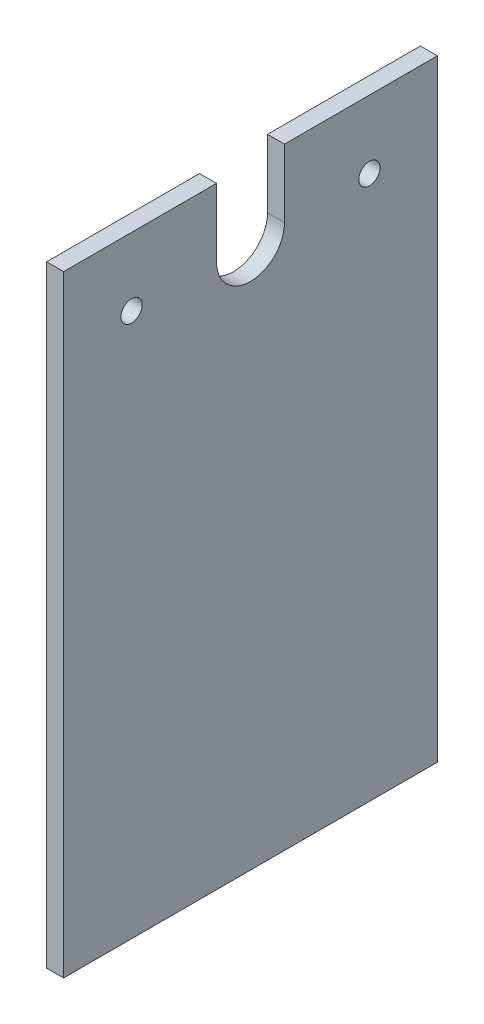
ISO-10303-21;
HEADER;
FILE_DESCRIPTION(('STEP AP214'),'2;1');
FILE_NAME('part.step','',(''),(''),'','','');
FILE_SCHEMA(('AUTOMOTIVE_DESIGN { 1 0 10303 214 1 1 1 1 }'));
ENDSEC;
DATA;
#1=APPLICATION_CONTEXT('core data for automotive mechanical design processes');
#2=APPLICATION_PROTOCOL_DEFINITION('international standard','automotive_design',2000,#1);
#3=PRODUCT_CONTEXT('',#1,'mechanical');
#4=PRODUCT('Part','Part','',(#3));
#5=PRODUCT_RELATED_PRODUCT_CATEGORY('part','',(#4));
#6=PRODUCT_DEFINITION_FORMATION('','',#4);
#7=PRODUCT_DEFINITION_CONTEXT('part definition',#1,'design');
#8=PRODUCT_DEFINITION('design','',#6,#7);
#9=PRODUCT_DEFINITION_SHAPE('','',#8);
#10=(LENGTH_UNIT() NAMED_UNIT(*) SI_UNIT(.MILLI.,.METRE.));
#11=(NAMED_UNIT(*) PLANE_ANGLE_UNIT() SI_UNIT($,.RADIAN.));
#12=(NAMED_UNIT(*) SI_UNIT($,.STERADIAN.) SOLID_ANGLE_UNIT());
#13=UNCERTAINTY_MEASURE_WITH_UNIT(LENGTH_MEASURE(1.E-05),#10,'distance_accuracy_value','');
#14=(GEOMETRIC_REPRESENTATION_CONTEXT(3) GLOBAL_UNCERTAINTY_ASSIGNED_CONTEXT((#13)) GLOBAL_UNIT_ASSIGNED_CONTEXT((#10,
#11,#12)) REPRESENTATION_CONTEXT('',''));
#15=CARTESIAN_POINT('',(0.,0.,0.));
#16=DIRECTION('',(0.,0.,1.));
#17=DIRECTION('',(1.,0.,0.));
#18=AXIS2_PLACEMENT_3D('',#15,#16,#17);
#19=CARTESIAN_POINT('',(522.5,330.,-22.5));
#20=DIRECTION('',(0.,-1.,0.));
#21=DIRECTION('',(0.,0.,-1.));
#22=AXIS2_PLACEMENT_3D('',#19,#20,#21);
#23=PLANE('',#22);
#24=DIRECTION('',(0.,0.,1.));
#25=VECTOR('',#24,1.);
#26=CARTESIAN_POINT('',(512.5,330.,-22.5));
#27=LINE('',#26,#25);
#28=CARTESIAN_POINT('',(512.5,330.,-242.5));
#29=VERTEX_POINT('',#28);
#30=CARTESIAN_POINT('',(512.5,330.,-152.5));
#31=VERTEX_POINT('',#30);
#32=EDGE_CURVE('E130',#29,#31,#27,.T.);
#33=ORIENTED_EDGE('',*,*,#32,.T.);
#34=DIRECTION('',(-1.,0.,0.));
#35=VECTOR('',#34,1.);
#36=CARTESIAN_POINT('',(522.501,330.,-152.5));
#37=LINE('',#36,#35);
#38=CARTESIAN_POINT('',(522.5,330.,-152.5));
#39=VERTEX_POINT('',#38);
#40=EDGE_CURVE('E122',#39,#31,#37,.T.);
#41=ORIENTED_EDGE('',*,*,#40,.F.);
#42=DIRECTION('',(0.,0.,1.));
#43=VECTOR('',#42,1.);
#44=CARTESIAN_POINT('',(522.5,330.,-22.5));
#45=LINE('',#44,#43);
#46=CARTESIAN_POINT('',(522.5,330.,-242.5));
#47=VERTEX_POINT('',#46);
#48=EDGE_CURVE('E142',#47,#39,#45,.T.);
#49=ORIENTED_EDGE('',*,*,#48,.F.);
#50=DIRECTION('',(-1.,0.,0.));
#51=VECTOR('',#50,1.);
#52=CARTESIAN_POINT('',(522.5,330.,-242.5));
#53=LINE('',#52,#51);
#54=EDGE_CURVE('E141',#47,#29,#53,.T.);
#55=ORIENTED_EDGE('',*,*,#54,.T.);
#56=EDGE_LOOP('',(#33,#41,#49,#55));
#57=FACE_BOUND('',#56,.T.);
#58=ADVANCED_FACE('F39',(#57),#23,.F.);
#59=CARTESIAN_POINT('',(522.5,-30.,-22.5000000000004));
#60=DIRECTION('',(0.,0.,-1.));
#61=DIRECTION('',(0.,1.,0.));
#62=AXIS2_PLACEMENT_3D('',#59,#60,#61);
#63=PLANE('',#62);
#64=DIRECTION('',(0.,-1.,0.));
#65=VECTOR('',#64,1.);
#66=CARTESIAN_POINT('',(512.5,-30.,-22.5000000000004));
#67=LINE('',#66,#65);
#68=CARTESIAN_POINT('',(512.5,330.,-22.5));
#69=VERTEX_POINT('',#68);
#70=CARTESIAN_POINT('',(512.5,-30.,-22.5000000000004));
#71=VERTEX_POINT('',#70);
#72=EDGE_CURVE('E129',#69,#71,#67,.T.);
#73=ORIENTED_EDGE('',*,*,#72,.T.);
#74=DIRECTION('',(-1.,0.,0.));
#75=VECTOR('',#74,1.);
#76=CARTESIAN_POINT('',(522.5,-30.,-22.5000000000004));
#77=LINE('',#76,#75);
#78=CARTESIAN_POINT('',(522.5,-30.,-22.5000000000004));
#79=VERTEX_POINT('',#78);
#80=EDGE_CURVE('E12',#79,#71,#77,.T.);
#81=ORIENTED_EDGE('',*,*,#80,.F.);
#82=DIRECTION('',(0.,-1.,0.));
#83=VECTOR('',#82,1.);
#84=CARTESIAN_POINT('',(522.5,-30.,-22.5000000000004));
#85=LINE('',#84,#83);
#86=CARTESIAN_POINT('',(522.5,330.,-22.5));
#87=VERTEX_POINT('',#86);
#88=EDGE_CURVE('E134',#87,#79,#85,.T.);
#89=ORIENTED_EDGE('',*,*,#88,.F.);
#90=DIRECTION('',(-1.,0.,0.));
#91=VECTOR('',#90,1.);
#92=CARTESIAN_POINT('',(522.5,330.,-22.5));
#93=LINE('',#92,#91);
#94=EDGE_CURVE('E139',#87,#69,#93,.T.);
#95=ORIENTED_EDGE('',*,*,#94,.T.);
#96=EDGE_LOOP('',(#73,#81,#89,#95));
#97=FACE_BOUND('',#96,.T.);
#98=ADVANCED_FACE('F41',(#97),#63,.F.);
#99=CARTESIAN_POINT('',(522.5,-30.,-22.5000000000004));
#100=DIRECTION('',(0.,1.,0.));
#101=DIRECTION('',(0.,0.,1.));
#102=AXIS2_PLACEMENT_3D('',#99,#100,#101);
#103=PLANE('',#102);
#104=DIRECTION('',(0.,0.,-1.));
#105=VECTOR('',#104,1.);
#106=CARTESIAN_POINT('',(512.5,-30.,-22.5000000000004));
#107=LINE('',#106,#105);
#108=CARTESIAN_POINT('',(512.5,-30.,-242.5));
#109=VERTEX_POINT('',#108);
#110=EDGE_CURVE('E135',#71,#109,#107,.T.);
#111=ORIENTED_EDGE('',*,*,#110,.T.);
#112=DIRECTION('',(-1.,0.,0.));
#113=VECTOR('',#112,1.);
#114=CARTESIAN_POINT('',(522.5,-30.,-242.5));
#115=LINE('',#114,#113);
#116=CARTESIAN_POINT('',(522.5,-30.,-242.5));
#117=VERTEX_POINT('',#116);
#118=EDGE_CURVE('E47',#117,#109,#115,.T.);
#119=ORIENTED_EDGE('',*,*,#118,.F.);
#120=DIRECTION('',(0.,0.,-1.));
#121=VECTOR('',#120,1.);
#122=CARTESIAN_POINT('',(522.5,-30.,-22.5000000000004));
#123=LINE('',#122,#121);
#124=EDGE_CURVE('E92',#79,#117,#123,.T.);
#125=ORIENTED_EDGE('',*,*,#124,.F.);
#126=ORIENTED_EDGE('',*,*,#80,.T.);
#127=EDGE_LOOP('',(#111,#119,#125,#126));
#128=FACE_BOUND('',#127,.T.);
#129=ADVANCED_FACE('F195',(#128),#103,.F.);
#130=CARTESIAN_POINT('',(522.5,-30.,-242.5));
#131=DIRECTION('',(0.,0.,1.));
#132=DIRECTION('',(1.,0.,0.));
#133=AXIS2_PLACEMENT_3D('',#130,#131,#132);
#134=PLANE('',#133);
#135=DIRECTION('',(0.,1.,0.));
#136=VECTOR('',#135,1.);
#137=CARTESIAN_POINT('',(512.5,-30.,-242.5));
#138=LINE('',#137,#136);
#139=EDGE_CURVE('E131',#109,#29,#138,.T.);
#140=ORIENTED_EDGE('',*,*,#139,.T.);
#141=ORIENTED_EDGE('',*,*,#54,.F.);
#142=DIRECTION('',(0.,1.,0.));
#143=VECTOR('',#142,1.);
#144=CARTESIAN_POINT('',(522.5,-30.,-242.5));
#145=LINE('',#144,#143);
#146=EDGE_CURVE('E150',#117,#47,#145,.T.);
#147=ORIENTED_EDGE('',*,*,#146,.F.);
#148=ORIENTED_EDGE('',*,*,#118,.T.);
#149=EDGE_LOOP('',(#140,#141,#147,#148));
#150=FACE_BOUND('',#149,.T.);
#151=ADVANCED_FACE('F148',(#150),#134,.F.);
#152=CARTESIAN_POINT('',(522.5,330.,-112.5));
#153=VERTEX_POINT('',#152);
#154=EDGE_CURVE('E63',#153,#87,#45,.T.);
#155=ORIENTED_EDGE('',*,*,#154,.F.);
#156=DIRECTION('',(1.,0.,0.));
#157=VECTOR('',#156,1.);
#158=CARTESIAN_POINT('',(522.501,330.,-112.5));
#159=LINE('',#158,#157);
#160=CARTESIAN_POINT('',(512.5,330.,-112.5));
#161=VERTEX_POINT('',#160);
#162=EDGE_CURVE('E116',#161,#153,#159,.T.);
#163=ORIENTED_EDGE('',*,*,#162,.F.);
#164=EDGE_CURVE('E85',#161,#69,#27,.T.);
#165=ORIENTED_EDGE('',*,*,#164,.T.);
#166=ORIENTED_EDGE('',*,*,#94,.F.);
#167=EDGE_LOOP('',(#155,#163,#165,#166));
#168=FACE_BOUND('',#167,.T.);
#169=ADVANCED_FACE('F121',(#168),#23,.F.);
#170=CARTESIAN_POINT('',(522.5,0.,0.));
#171=DIRECTION('',(-1.,0.,0.));
#172=DIRECTION('',(0.,0.,1.));
#173=AXIS2_PLACEMENT_3D('',#170,#171,#172);
#174=PLANE('',#173);
#175=CARTESIAN_POINT('',(522.5,290.,-62.5));
#176=DIRECTION('',(-1.,0.,0.));
#177=DIRECTION('',(0.,0.,1.));
#178=AXIS2_PLACEMENT_3D('',#175,#176,#177);
#179=CIRCLE('',#178,6.25000000000001);
#180=CARTESIAN_POINT('',(522.5,290.,-56.25));
#181=VERTEX_POINT('',#180);
#182=EDGE_CURVE('E216',#181,#181,#179,.F.);
#183=ORIENTED_EDGE('',*,*,#182,.F.);
#184=EDGE_LOOP('',(#183));
#185=FACE_BOUND('',#184,.T.);
#186=CARTESIAN_POINT('',(522.5,290.,-202.5));
#187=DIRECTION('',(-1.,0.,0.));
#188=DIRECTION('',(0.,0.,1.));
#189=AXIS2_PLACEMENT_3D('',#186,#187,#188);
#190=CIRCLE('',#189,6.25);
#191=CARTESIAN_POINT('',(522.5,290.,-196.25));
#192=VERTEX_POINT('',#191);
#193=EDGE_CURVE('E123',#192,#192,#190,.F.);
#194=ORIENTED_EDGE('',*,*,#193,.F.);
#195=EDGE_LOOP('',(#194));
#196=FACE_BOUND('',#195,.T.);
#197=ORIENTED_EDGE('',*,*,#48,.T.);
#198=DIRECTION('',(0.,1.,0.));
#199=VECTOR('',#198,1.);
#200=CARTESIAN_POINT('',(522.5,290.,-152.5));
#201=LINE('',#200,#199);
#202=CARTESIAN_POINT('',(522.5,290.,-152.5));
#203=VERTEX_POINT('',#202);
#204=EDGE_CURVE('E210',#203,#39,#201,.T.);
#205=ORIENTED_EDGE('',*,*,#204,.F.);
#206=CARTESIAN_POINT('',(522.5,290.,-132.5));
#207=DIRECTION('',(-1.,0.,0.));
#208=DIRECTION('',(0.,0.,1.));
#209=AXIS2_PLACEMENT_3D('',#206,#207,#208);
#210=CIRCLE('',#209,20.);
#211=CARTESIAN_POINT('',(522.5,290.,-112.5));
#212=VERTEX_POINT('',#211);
#213=EDGE_CURVE('E213',#212,#203,#210,.F.);
#214=ORIENTED_EDGE('',*,*,#213,.F.);
#215=DIRECTION('',(0.,-1.,0.));
#216=VECTOR('',#215,1.);
#217=CARTESIAN_POINT('',(522.5,290.,-112.5));
#218=LINE('',#217,#216);
#219=EDGE_CURVE('E172',#153,#212,#218,.T.);
#220=ORIENTED_EDGE('',*,*,#219,.F.);
#221=ORIENTED_EDGE('',*,*,#154,.T.);
#222=ORIENTED_EDGE('',*,*,#88,.T.);
#223=ORIENTED_EDGE('',*,*,#124,.T.);
#224=ORIENTED_EDGE('',*,*,#146,.T.);
#225=EDGE_LOOP('',(#197,#205,#214,#220,#221,#222,#223,#224));
#226=FACE_BOUND('',#225,.T.);
#227=ADVANCED_FACE('F176',(#185,#196,#226),#174,.F.);
#228=CARTESIAN_POINT('',(512.5,0.,0.));
#229=DIRECTION('',(-1.,0.,0.));
#230=DIRECTION('',(0.,0.,1.));
#231=AXIS2_PLACEMENT_3D('',#228,#229,#230);
#232=PLANE('',#231);
#233=CARTESIAN_POINT('',(512.5,290.,-62.5));
#234=DIRECTION('',(-1.,0.,0.));
#235=DIRECTION('',(0.,0.,-1.));
#236=AXIS2_PLACEMENT_3D('',#233,#234,#235);
#237=CIRCLE('',#236,6.25000000000001);
#238=CARTESIAN_POINT('',(512.5,290.,-68.75));
#239=VERTEX_POINT('',#238);
#240=EDGE_CURVE('E220',#239,#239,#237,.T.);
#241=ORIENTED_EDGE('',*,*,#240,.F.);
#242=EDGE_LOOP('',(#241));
#243=FACE_BOUND('',#242,.T.);
#244=CARTESIAN_POINT('',(512.5,290.,-202.5));
#245=DIRECTION('',(-1.,0.,0.));
#246=DIRECTION('',(0.,0.,1.));
#247=AXIS2_PLACEMENT_3D('',#244,#245,#246);
#248=CIRCLE('',#247,6.25);
#249=CARTESIAN_POINT('',(512.5,290.,-196.25));
#250=VERTEX_POINT('',#249);
#251=EDGE_CURVE('E219',#250,#250,#248,.T.);
#252=ORIENTED_EDGE('',*,*,#251,.F.);
#253=EDGE_LOOP('',(#252));
#254=FACE_BOUND('',#253,.T.);
#255=DIRECTION('',(0.,-1.,0.));
#256=VECTOR('',#255,1.);
#257=CARTESIAN_POINT('',(512.5,290.,-152.5));
#258=LINE('',#257,#256);
#259=CARTESIAN_POINT('',(512.5,290.,-152.5));
#260=VERTEX_POINT('',#259);
#261=EDGE_CURVE('E119',#31,#260,#258,.T.);
#262=ORIENTED_EDGE('',*,*,#261,.F.);
#263=ORIENTED_EDGE('',*,*,#32,.F.);
#264=ORIENTED_EDGE('',*,*,#139,.F.);
#265=ORIENTED_EDGE('',*,*,#110,.F.);
#266=ORIENTED_EDGE('',*,*,#72,.F.);
#267=ORIENTED_EDGE('',*,*,#164,.F.);
#268=DIRECTION('',(0.,1.,0.));
#269=VECTOR('',#268,1.);
#270=CARTESIAN_POINT('',(512.5,290.,-112.5));
#271=LINE('',#270,#269);
#272=CARTESIAN_POINT('',(512.5,290.,-112.5));
#273=VERTEX_POINT('',#272);
#274=EDGE_CURVE('E113',#273,#161,#271,.T.);
#275=ORIENTED_EDGE('',*,*,#274,.F.);
#276=CARTESIAN_POINT('',(512.5,290.,-132.5));
#277=DIRECTION('',(-1.,0.,0.));
#278=DIRECTION('',(0.,0.,1.));
#279=AXIS2_PLACEMENT_3D('',#276,#277,#278);
#280=CIRCLE('',#279,20.);
#281=EDGE_CURVE('E54',#260,#273,#280,.T.);
#282=ORIENTED_EDGE('',*,*,#281,.F.);
#283=EDGE_LOOP('',(#262,#263,#264,#265,#266,#267,#275,#282));
#284=FACE_BOUND('',#283,.T.);
#285=ADVANCED_FACE('F127',(#243,#254,#284),#232,.T.);
#286=CARTESIAN_POINT('',(522.501,290.,-132.5));
#287=DIRECTION('',(-1.,0.,0.));
#288=DIRECTION('',(0.,0.,1.));
#289=AXIS2_PLACEMENT_3D('',#286,#287,#288);
#290=CYLINDRICAL_SURFACE('',#289,20.);
#291=ORIENTED_EDGE('',*,*,#213,.T.);
#292=DIRECTION('',(-1.,0.,0.));
#293=VECTOR('',#292,1.);
#294=CARTESIAN_POINT('',(522.501,290.,-152.5));
#295=LINE('',#294,#293);
#296=EDGE_CURVE('E203',#203,#260,#295,.T.);
#297=ORIENTED_EDGE('',*,*,#296,.T.);
#298=ORIENTED_EDGE('',*,*,#281,.T.);
#299=DIRECTION('',(-1.,0.,0.));
#300=VECTOR('',#299,1.);
#301=CARTESIAN_POINT('',(522.501,290.,-112.5));
#302=LINE('',#301,#300);
#303=EDGE_CURVE('E117',#212,#273,#302,.T.);
#304=ORIENTED_EDGE('',*,*,#303,.F.);
#305=EDGE_LOOP('',(#291,#297,#298,#304));
#306=FACE_BOUND('',#305,.T.);
#307=ADVANCED_FACE('F184',(#306),#290,.F.);
#308=CARTESIAN_POINT('',(522.501,290.,-152.5));
#309=DIRECTION('',(0.,0.,-1.));
#310=DIRECTION('',(-1.,0.,0.));
#311=AXIS2_PLACEMENT_3D('',#308,#309,#310);
#312=PLANE('',#311);
#313=ORIENTED_EDGE('',*,*,#40,.T.);
#314=ORIENTED_EDGE('',*,*,#261,.T.);
#315=ORIENTED_EDGE('',*,*,#296,.F.);
#316=ORIENTED_EDGE('',*,*,#204,.T.);
#317=EDGE_LOOP('',(#313,#314,#315,#316));
#318=FACE_BOUND('',#317,.T.);
#319=ADVANCED_FACE('F241',(#318),#312,.F.);
#320=CARTESIAN_POINT('',(522.501,290.,-112.5));
#321=DIRECTION('',(0.,0.,1.));
#322=DIRECTION('',(1.,0.,0.));
#323=AXIS2_PLACEMENT_3D('',#320,#321,#322);
#324=PLANE('',#323);
#325=ORIENTED_EDGE('',*,*,#162,.T.);
#326=ORIENTED_EDGE('',*,*,#219,.T.);
#327=ORIENTED_EDGE('',*,*,#303,.T.);
#328=ORIENTED_EDGE('',*,*,#274,.T.);
#329=EDGE_LOOP('',(#325,#326,#327,#328));
#330=FACE_BOUND('',#329,.T.);
#331=ADVANCED_FACE('F114',(#330),#324,.F.);
#332=CARTESIAN_POINT('',(522.501,290.,-202.5));
#333=DIRECTION('',(-1.,0.,0.));
#334=DIRECTION('',(0.,0.,1.));
#335=AXIS2_PLACEMENT_3D('',#332,#333,#334);
#336=CYLINDRICAL_SURFACE('',#335,6.25);
#337=ORIENTED_EDGE('',*,*,#251,.T.);
#338=EDGE_LOOP('',(#337));
#339=FACE_BOUND('',#338,.T.);
#340=ORIENTED_EDGE('',*,*,#193,.T.);
#341=EDGE_LOOP('',(#340));
#342=FACE_BOUND('',#341,.T.);
#343=ADVANCED_FACE('F228',(#339,#342),#336,.F.);
#344=CARTESIAN_POINT('',(522.501,290.,-62.5));
#345=DIRECTION('',(-1.,0.,0.));
#346=DIRECTION('',(0.,0.,1.));
#347=AXIS2_PLACEMENT_3D('',#344,#345,#346);
#348=CYLINDRICAL_SURFACE('',#347,6.25000000000001);
#349=ORIENTED_EDGE('',*,*,#240,.T.);
#350=EDGE_LOOP('',(#349));
#351=FACE_BOUND('',#350,.T.);
#352=ORIENTED_EDGE('',*,*,#182,.T.);
#353=EDGE_LOOP('',(#352));
#354=FACE_BOUND('',#353,.T.);
#355=ADVANCED_FACE('F232',(#351,#354),#348,.F.);
#356=CLOSED_SHELL('',(#58,#98,#129,#151,#169,#227,#285,#307,#319,#331,#343,#355));
#357=MANIFOLD_SOLID_BREP('B2',#356);
#358=ADVANCED_BREP_SHAPE_REPRESENTATION('',(#18,#357),#14);
#359=SHAPE_DEFINITION_REPRESENTATION(#9,#358);
ENDSEC;
END-ISO-10303-21;
